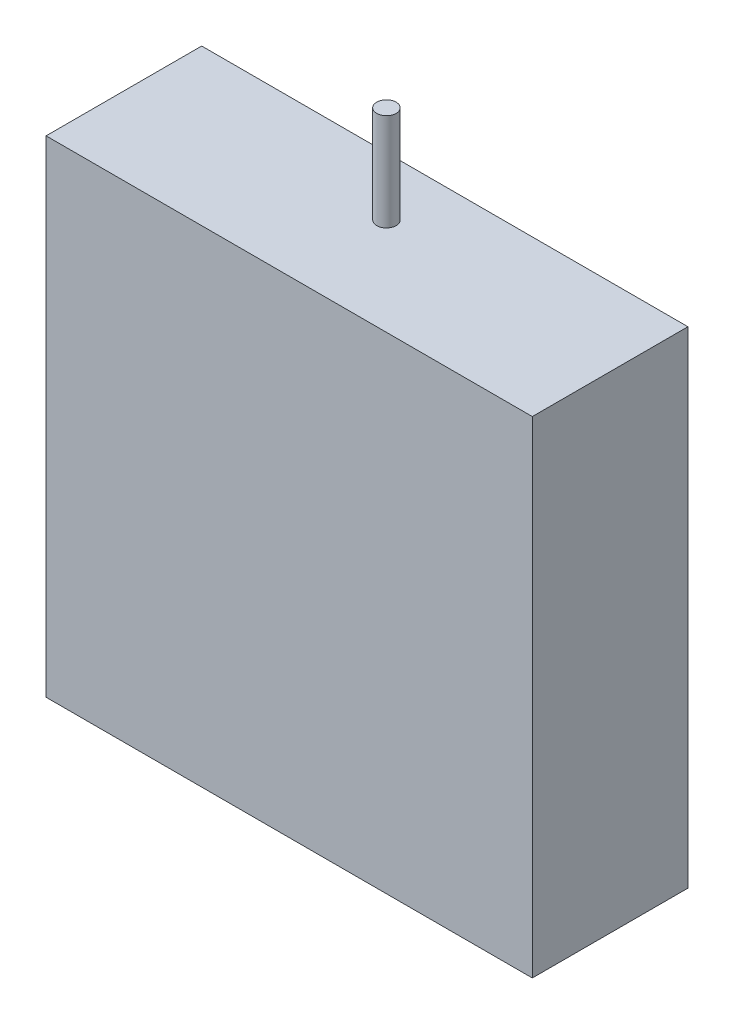
ISO-10303-21;
HEADER;
FILE_DESCRIPTION(('STEP AP214'),'2;1');
FILE_NAME('part.step','',(''),(''),'','','');
FILE_SCHEMA(('AUTOMOTIVE_DESIGN { 1 0 10303 214 1 1 1 1 }'));
ENDSEC;
DATA;
#1=APPLICATION_CONTEXT('core data for automotive mechanical design processes');
#2=APPLICATION_PROTOCOL_DEFINITION('international standard','automotive_design',2000,#1);
#3=PRODUCT_CONTEXT('',#1,'mechanical');
#4=PRODUCT('Part','Part','',(#3));
#5=PRODUCT_RELATED_PRODUCT_CATEGORY('part','',(#4));
#6=PRODUCT_DEFINITION_FORMATION('','',#4);
#7=PRODUCT_DEFINITION_CONTEXT('part definition',#1,'design');
#8=PRODUCT_DEFINITION('design','',#6,#7);
#9=PRODUCT_DEFINITION_SHAPE('','',#8);
#10=(LENGTH_UNIT() NAMED_UNIT(*) SI_UNIT(.MILLI.,.METRE.));
#11=(NAMED_UNIT(*) PLANE_ANGLE_UNIT() SI_UNIT($,.RADIAN.));
#12=(NAMED_UNIT(*) SI_UNIT($,.STERADIAN.) SOLID_ANGLE_UNIT());
#13=UNCERTAINTY_MEASURE_WITH_UNIT(LENGTH_MEASURE(1.E-05),#10,'distance_accuracy_value','');
#14=(GEOMETRIC_REPRESENTATION_CONTEXT(3) GLOBAL_UNCERTAINTY_ASSIGNED_CONTEXT((#13)) GLOBAL_UNIT_ASSIGNED_CONTEXT((#10,
#11,#12)) REPRESENTATION_CONTEXT('',''));
#15=CARTESIAN_POINT('',(0.,0.,0.));
#16=DIRECTION('',(0.,0.,1.));
#17=DIRECTION('',(1.,0.,0.));
#18=AXIS2_PLACEMENT_3D('',#15,#16,#17);
#19=CARTESIAN_POINT('',(12.5,12.5,8.));
#20=DIRECTION('',(-1.,0.,0.));
#21=DIRECTION('',(0.,-1.,0.));
#22=AXIS2_PLACEMENT_3D('',#19,#20,#21);
#23=PLANE('',#22);
#24=DIRECTION('',(0.,1.,0.));
#25=VECTOR('',#24,1.);
#26=CARTESIAN_POINT('',(12.5,12.5,0.));
#27=LINE('',#26,#25);
#28=CARTESIAN_POINT('',(12.5,-12.5,0.));
#29=VERTEX_POINT('',#28);
#30=CARTESIAN_POINT('',(12.5,12.5,0.));
#31=VERTEX_POINT('',#30);
#32=EDGE_CURVE('E114',#29,#31,#27,.T.);
#33=ORIENTED_EDGE('',*,*,#32,.T.);
#34=DIRECTION('',(0.,0.,-1.));
#35=VECTOR('',#34,1.);
#36=CARTESIAN_POINT('',(12.5,12.5,8.));
#37=LINE('',#36,#35);
#38=CARTESIAN_POINT('',(12.5,12.5,8.));
#39=VERTEX_POINT('',#38);
#40=EDGE_CURVE('E52',#39,#31,#37,.T.);
#41=ORIENTED_EDGE('',*,*,#40,.F.);
#42=DIRECTION('',(0.,1.,0.));
#43=VECTOR('',#42,1.);
#44=CARTESIAN_POINT('',(12.5,12.5,8.));
#45=LINE('',#44,#43);
#46=CARTESIAN_POINT('',(12.5,-12.5,8.));
#47=VERTEX_POINT('',#46);
#48=EDGE_CURVE('E96',#47,#39,#45,.T.);
#49=ORIENTED_EDGE('',*,*,#48,.F.);
#50=DIRECTION('',(0.,0.,-1.));
#51=VECTOR('',#50,1.);
#52=CARTESIAN_POINT('',(12.5,-12.5,8.));
#53=LINE('',#52,#51);
#54=EDGE_CURVE('E110',#47,#29,#53,.T.);
#55=ORIENTED_EDGE('',*,*,#54,.T.);
#56=EDGE_LOOP('',(#33,#41,#49,#55));
#57=FACE_BOUND('',#56,.T.);
#58=ADVANCED_FACE('F43',(#57),#23,.F.);
#59=CARTESIAN_POINT('',(-12.5,12.5,8.));
#60=DIRECTION('',(0.,-1.,0.));
#61=DIRECTION('',(0.,0.,-1.));
#62=AXIS2_PLACEMENT_3D('',#59,#60,#61);
#63=PLANE('',#62);
#64=CARTESIAN_POINT('',(0.,12.5,3.));
#65=DIRECTION('',(0.,-1.,0.));
#66=DIRECTION('',(0.,0.,-1.));
#67=AXIS2_PLACEMENT_3D('',#64,#65,#66);
#68=CIRCLE('',#67,0.5);
#69=CARTESIAN_POINT('',(0.,12.5,2.5));
#70=VERTEX_POINT('',#69);
#71=EDGE_CURVE('E11',#70,#70,#68,.F.);
#72=ORIENTED_EDGE('',*,*,#71,.F.);
#73=EDGE_LOOP('',(#72));
#74=FACE_BOUND('',#73,.T.);
#75=DIRECTION('',(-1.,0.,0.));
#76=VECTOR('',#75,1.);
#77=CARTESIAN_POINT('',(-12.5,12.5,0.));
#78=LINE('',#77,#76);
#79=CARTESIAN_POINT('',(-12.5,12.5,0.));
#80=VERTEX_POINT('',#79);
#81=EDGE_CURVE('E102',#31,#80,#78,.T.);
#82=ORIENTED_EDGE('',*,*,#81,.T.);
#83=DIRECTION('',(0.,0.,-1.));
#84=VECTOR('',#83,1.);
#85=CARTESIAN_POINT('',(-12.5,12.5,8.));
#86=LINE('',#85,#84);
#87=CARTESIAN_POINT('',(-12.5,12.5,8.));
#88=VERTEX_POINT('',#87);
#89=EDGE_CURVE('E100',#88,#80,#86,.T.);
#90=ORIENTED_EDGE('',*,*,#89,.F.);
#91=DIRECTION('',(-1.,0.,0.));
#92=VECTOR('',#91,1.);
#93=CARTESIAN_POINT('',(-12.5,12.5,8.));
#94=LINE('',#93,#92);
#95=EDGE_CURVE('E91',#39,#88,#94,.T.);
#96=ORIENTED_EDGE('',*,*,#95,.F.);
#97=ORIENTED_EDGE('',*,*,#40,.T.);
#98=EDGE_LOOP('',(#82,#90,#96,#97));
#99=FACE_BOUND('',#98,.T.);
#100=ADVANCED_FACE('F101',(#74,#99),#63,.F.);
#101=CARTESIAN_POINT('',(-12.5,12.5,8.));
#102=DIRECTION('',(1.,0.,0.));
#103=DIRECTION('',(0.,1.,0.));
#104=AXIS2_PLACEMENT_3D('',#101,#102,#103);
#105=PLANE('',#104);
#106=DIRECTION('',(0.,-1.,0.));
#107=VECTOR('',#106,1.);
#108=CARTESIAN_POINT('',(-12.5,12.5,0.));
#109=LINE('',#108,#107);
#110=CARTESIAN_POINT('',(-12.5,-12.5,0.));
#111=VERTEX_POINT('',#110);
#112=EDGE_CURVE('E77',#80,#111,#109,.T.);
#113=ORIENTED_EDGE('',*,*,#112,.T.);
#114=DIRECTION('',(0.,0.,-1.));
#115=VECTOR('',#114,1.);
#116=CARTESIAN_POINT('',(-12.5,-12.5,8.));
#117=LINE('',#116,#115);
#118=CARTESIAN_POINT('',(-12.5,-12.5,8.));
#119=VERTEX_POINT('',#118);
#120=EDGE_CURVE('E104',#119,#111,#117,.T.);
#121=ORIENTED_EDGE('',*,*,#120,.F.);
#122=DIRECTION('',(0.,-1.,0.));
#123=VECTOR('',#122,1.);
#124=CARTESIAN_POINT('',(-12.5,12.5,8.));
#125=LINE('',#124,#123);
#126=EDGE_CURVE('E94',#88,#119,#125,.T.);
#127=ORIENTED_EDGE('',*,*,#126,.F.);
#128=ORIENTED_EDGE('',*,*,#89,.T.);
#129=EDGE_LOOP('',(#113,#121,#127,#128));
#130=FACE_BOUND('',#129,.T.);
#131=ADVANCED_FACE('F106',(#130),#105,.F.);
#132=CARTESIAN_POINT('',(-12.5,-12.5,8.));
#133=DIRECTION('',(0.,1.,0.));
#134=DIRECTION('',(0.,0.,1.));
#135=AXIS2_PLACEMENT_3D('',#132,#133,#134);
#136=PLANE('',#135);
#137=DIRECTION('',(1.,0.,0.));
#138=VECTOR('',#137,1.);
#139=CARTESIAN_POINT('',(-12.5,-12.5,0.));
#140=LINE('',#139,#138);
#141=EDGE_CURVE('E83',#111,#29,#140,.T.);
#142=ORIENTED_EDGE('',*,*,#141,.T.);
#143=ORIENTED_EDGE('',*,*,#54,.F.);
#144=DIRECTION('',(1.,0.,0.));
#145=VECTOR('',#144,1.);
#146=CARTESIAN_POINT('',(-12.5,-12.5,8.));
#147=LINE('',#146,#145);
#148=EDGE_CURVE('E60',#119,#47,#147,.T.);
#149=ORIENTED_EDGE('',*,*,#148,.F.);
#150=ORIENTED_EDGE('',*,*,#120,.T.);
#151=EDGE_LOOP('',(#142,#143,#149,#150));
#152=FACE_BOUND('',#151,.T.);
#153=ADVANCED_FACE('F143',(#152),#136,.F.);
#154=CARTESIAN_POINT('',(0.,0.,8.));
#155=DIRECTION('',(0.,0.,1.));
#156=DIRECTION('',(1.,0.,0.));
#157=AXIS2_PLACEMENT_3D('',#154,#155,#156);
#158=PLANE('',#157);
#159=ORIENTED_EDGE('',*,*,#48,.T.);
#160=ORIENTED_EDGE('',*,*,#95,.T.);
#161=ORIENTED_EDGE('',*,*,#126,.T.);
#162=ORIENTED_EDGE('',*,*,#148,.T.);
#163=EDGE_LOOP('',(#159,#160,#161,#162));
#164=FACE_BOUND('',#163,.T.);
#165=ADVANCED_FACE('F92',(#164),#158,.T.);
#166=CARTESIAN_POINT('',(0.,0.,0.));
#167=DIRECTION('',(0.,0.,1.));
#168=DIRECTION('',(1.,0.,0.));
#169=AXIS2_PLACEMENT_3D('',#166,#167,#168);
#170=PLANE('',#169);
#171=ORIENTED_EDGE('',*,*,#32,.F.);
#172=ORIENTED_EDGE('',*,*,#141,.F.);
#173=ORIENTED_EDGE('',*,*,#112,.F.);
#174=ORIENTED_EDGE('',*,*,#81,.F.);
#175=EDGE_LOOP('',(#171,#172,#173,#174));
#176=FACE_BOUND('',#175,.T.);
#177=ADVANCED_FACE('F132',(#176),#170,.F.);
#178=CARTESIAN_POINT('',(0.,17.5,3.));
#179=DIRECTION('',(0.,-1.,0.));
#180=DIRECTION('',(0.,0.,-1.));
#181=AXIS2_PLACEMENT_3D('',#178,#179,#180);
#182=CYLINDRICAL_SURFACE('',#181,0.5);
#183=CARTESIAN_POINT('',(0.,17.5,3.));
#184=DIRECTION('',(0.,1.,0.));
#185=DIRECTION('',(0.,0.,1.));
#186=AXIS2_PLACEMENT_3D('',#183,#184,#185);
#187=CIRCLE('',#186,0.5);
#188=CARTESIAN_POINT('',(0.,17.5,3.5));
#189=VERTEX_POINT('',#188);
#190=EDGE_CURVE('E118',#189,#189,#187,.T.);
#191=ORIENTED_EDGE('',*,*,#190,.F.);
#192=EDGE_LOOP('',(#191));
#193=FACE_BOUND('',#192,.T.);
#194=ORIENTED_EDGE('',*,*,#71,.T.);
#195=EDGE_LOOP('',(#194));
#196=FACE_BOUND('',#195,.T.);
#197=ADVANCED_FACE('F134',(#193,#196),#182,.T.);
#198=CARTESIAN_POINT('',(0.,17.5,3.));
#199=DIRECTION('',(0.,1.,0.));
#200=DIRECTION('',(0.,0.,1.));
#201=AXIS2_PLACEMENT_3D('',#198,#199,#200);
#202=PLANE('',#201);
#203=ORIENTED_EDGE('',*,*,#190,.T.);
#204=EDGE_LOOP('',(#203));
#205=FACE_BOUND('',#204,.T.);
#206=ADVANCED_FACE('F140',(#205),#202,.T.);
#207=CLOSED_SHELL('',(#58,#100,#131,#153,#165,#177,#197,#206));
#208=MANIFOLD_SOLID_BREP('B2',#207);
#209=ADVANCED_BREP_SHAPE_REPRESENTATION('',(#18,#208),#14);
#210=SHAPE_DEFINITION_REPRESENTATION(#9,#209);
ENDSEC;
END-ISO-10303-21;
